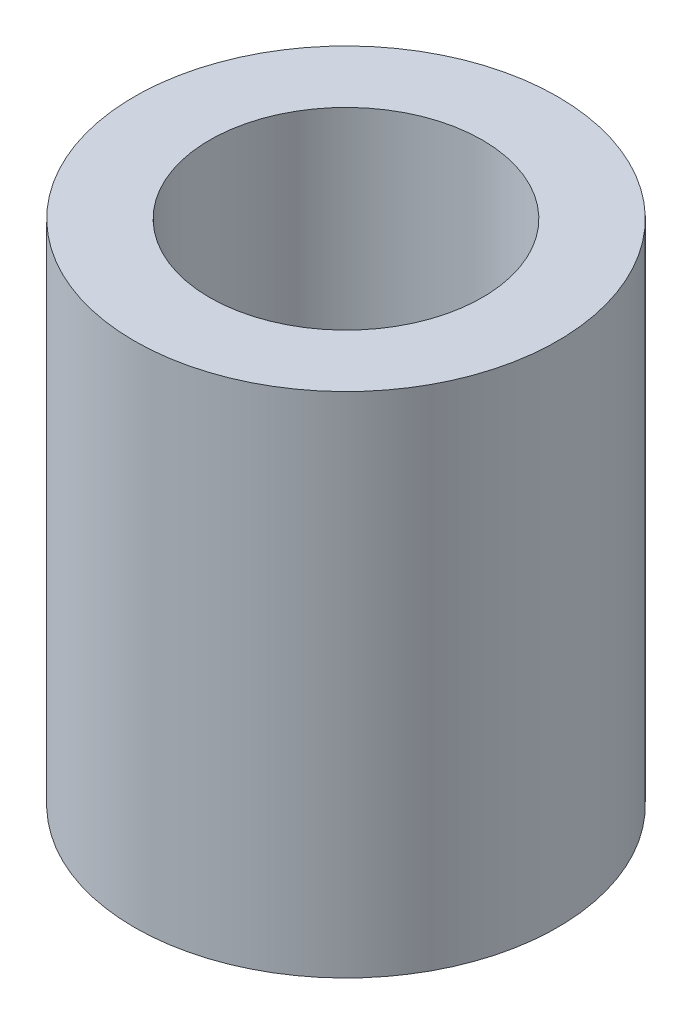
ISO-10303-21;
HEADER;
FILE_DESCRIPTION(('STEP AP214'),'2;1');
FILE_NAME('part.step','',(''),(''),'','','');
FILE_SCHEMA(('AUTOMOTIVE_DESIGN { 1 0 10303 214 1 1 1 1 }'));
ENDSEC;
DATA;
#1=APPLICATION_CONTEXT('core data for automotive mechanical design processes');
#2=APPLICATION_PROTOCOL_DEFINITION('international standard','automotive_design',2000,#1);
#3=PRODUCT_CONTEXT('',#1,'mechanical');
#4=PRODUCT('Part','Part','',(#3));
#5=PRODUCT_RELATED_PRODUCT_CATEGORY('part','',(#4));
#6=PRODUCT_DEFINITION_FORMATION('','',#4);
#7=PRODUCT_DEFINITION_CONTEXT('part definition',#1,'design');
#8=PRODUCT_DEFINITION('design','',#6,#7);
#9=PRODUCT_DEFINITION_SHAPE('','',#8);
#10=(LENGTH_UNIT() NAMED_UNIT(*) SI_UNIT(.MILLI.,.METRE.));
#11=(NAMED_UNIT(*) PLANE_ANGLE_UNIT() SI_UNIT($,.RADIAN.));
#12=(NAMED_UNIT(*) SI_UNIT($,.STERADIAN.) SOLID_ANGLE_UNIT());
#13=UNCERTAINTY_MEASURE_WITH_UNIT(LENGTH_MEASURE(1.E-05),#10,'distance_accuracy_value','');
#14=(GEOMETRIC_REPRESENTATION_CONTEXT(3) GLOBAL_UNCERTAINTY_ASSIGNED_CONTEXT((#13)) GLOBAL_UNIT_ASSIGNED_CONTEXT((#10,
#11,#12)) REPRESENTATION_CONTEXT('',''));
#15=CARTESIAN_POINT('',(0.,0.,0.));
#16=DIRECTION('',(0.,0.,1.));
#17=DIRECTION('',(1.,0.,0.));
#18=AXIS2_PLACEMENT_3D('',#15,#16,#17);
#19=CARTESIAN_POINT('',(0.,0.,0.));
#20=DIRECTION('',(0.,1.,0.));
#21=DIRECTION('',(0.,0.,1.));
#22=AXIS2_PLACEMENT_3D('',#19,#20,#21);
#23=CYLINDRICAL_SURFACE('',#22,2.3876);
#24=CARTESIAN_POINT('',(0.,0.,0.));
#25=DIRECTION('',(0.,1.,0.));
#26=DIRECTION('',(0.,0.,1.));
#27=AXIS2_PLACEMENT_3D('',#24,#25,#26);
#28=CIRCLE('',#27,2.3876);
#29=CARTESIAN_POINT('',(0.,0.,2.3876));
#30=VERTEX_POINT('',#29);
#31=EDGE_CURVE('E26',#30,#30,#28,.F.);
#32=ORIENTED_EDGE('',*,*,#31,.T.);
#33=EDGE_LOOP('',(#32));
#34=FACE_BOUND('',#33,.T.);
#35=CARTESIAN_POINT('',(0.,8.89,0.));
#36=DIRECTION('',(0.,1.,0.));
#37=DIRECTION('',(0.,0.,1.));
#38=AXIS2_PLACEMENT_3D('',#35,#36,#37);
#39=CIRCLE('',#38,2.3876);
#40=CARTESIAN_POINT('',(0.,8.89,2.3876));
#41=VERTEX_POINT('',#40);
#42=EDGE_CURVE('E17',#41,#41,#39,.F.);
#43=ORIENTED_EDGE('',*,*,#42,.F.);
#44=EDGE_LOOP('',(#43));
#45=FACE_BOUND('',#44,.T.);
#46=ADVANCED_FACE('F14',(#34,#45),#23,.F.);
#47=CARTESIAN_POINT('',(0.,8.89,0.));
#48=DIRECTION('',(0.,1.,0.));
#49=DIRECTION('',(0.,0.,1.));
#50=AXIS2_PLACEMENT_3D('',#47,#48,#49);
#51=PLANE('',#50);
#52=CARTESIAN_POINT('',(0.,8.89,0.));
#53=DIRECTION('',(0.,-1.,0.));
#54=DIRECTION('',(0.,0.,-1.));
#55=AXIS2_PLACEMENT_3D('',#52,#53,#54);
#56=CIRCLE('',#55,3.70459);
#57=CARTESIAN_POINT('',(0.,8.89,-3.70459));
#58=VERTEX_POINT('',#57);
#59=EDGE_CURVE('E21',#58,#58,#56,.T.);
#60=ORIENTED_EDGE('',*,*,#59,.F.);
#61=EDGE_LOOP('',(#60));
#62=FACE_BOUND('',#61,.T.);
#63=ORIENTED_EDGE('',*,*,#42,.T.);
#64=EDGE_LOOP('',(#63));
#65=FACE_BOUND('',#64,.T.);
#66=ADVANCED_FACE('F34',(#62,#65),#51,.T.);
#67=CARTESIAN_POINT('',(0.,0.,0.));
#68=DIRECTION('',(0.,1.,0.));
#69=DIRECTION('',(0.,0.,1.));
#70=AXIS2_PLACEMENT_3D('',#67,#68,#69);
#71=PLANE('',#70);
#72=CARTESIAN_POINT('',(0.,0.,0.));
#73=DIRECTION('',(0.,-1.,0.));
#74=DIRECTION('',(0.,0.,-1.));
#75=AXIS2_PLACEMENT_3D('',#72,#73,#74);
#76=CIRCLE('',#75,3.70459);
#77=CARTESIAN_POINT('',(0.,0.,-3.70459));
#78=VERTEX_POINT('',#77);
#79=EDGE_CURVE('E10',#78,#78,#76,.F.);
#80=ORIENTED_EDGE('',*,*,#79,.F.);
#81=EDGE_LOOP('',(#80));
#82=FACE_BOUND('',#81,.T.);
#83=ORIENTED_EDGE('',*,*,#31,.F.);
#84=EDGE_LOOP('',(#83));
#85=FACE_BOUND('',#84,.T.);
#86=ADVANCED_FACE('F41',(#82,#85),#71,.F.);
#87=CARTESIAN_POINT('',(0.,8.89,0.));
#88=DIRECTION('',(0.,-1.,0.));
#89=DIRECTION('',(0.,0.,-1.));
#90=AXIS2_PLACEMENT_3D('',#87,#88,#89);
#91=CYLINDRICAL_SURFACE('',#90,3.70459);
#92=ORIENTED_EDGE('',*,*,#79,.T.);
#93=EDGE_LOOP('',(#92));
#94=FACE_BOUND('',#93,.T.);
#95=ORIENTED_EDGE('',*,*,#59,.T.);
#96=EDGE_LOOP('',(#95));
#97=FACE_BOUND('',#96,.T.);
#98=ADVANCED_FACE('F43',(#94,#97),#91,.T.);
#99=CLOSED_SHELL('',(#46,#66,#86,#98));
#100=MANIFOLD_SOLID_BREP('B1',#99);
#101=ADVANCED_BREP_SHAPE_REPRESENTATION('',(#18,#100),#14);
#102=SHAPE_DEFINITION_REPRESENTATION(#9,#101);
ENDSEC;
END-ISO-10303-21;
